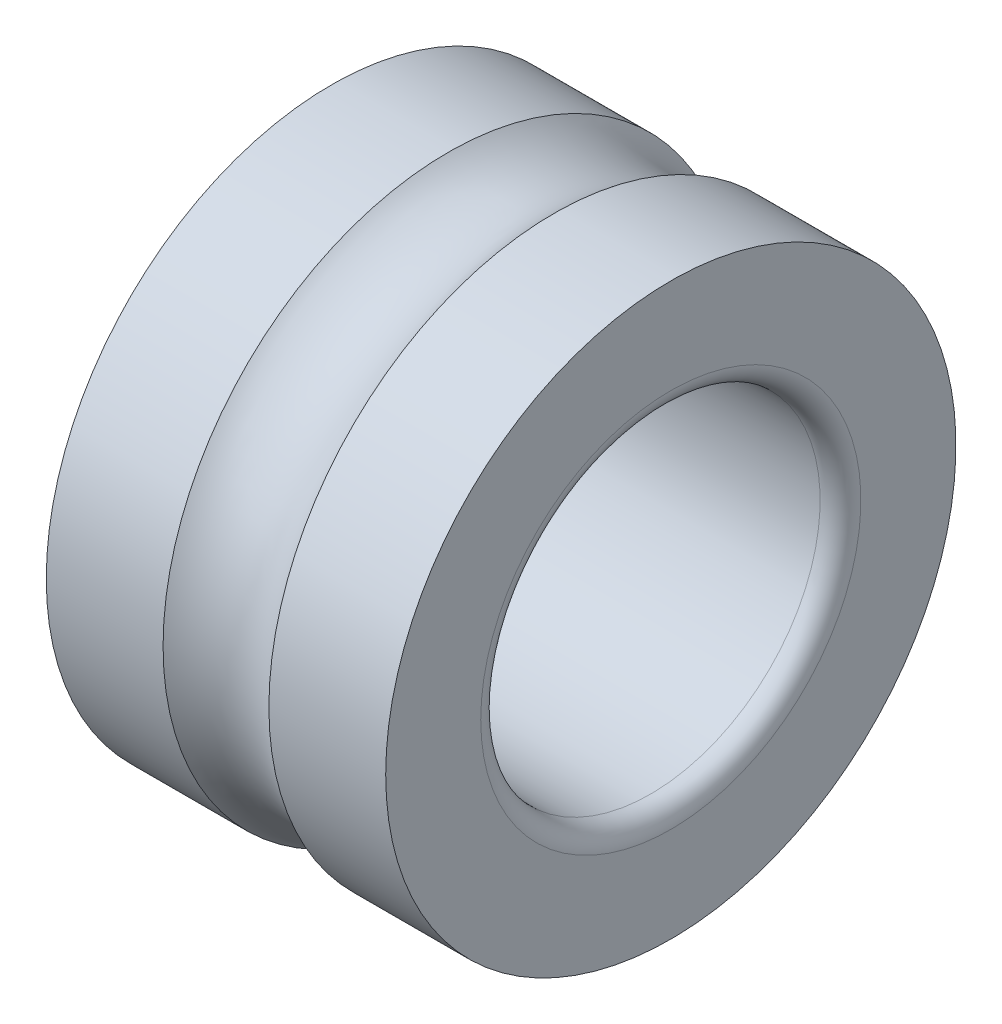
ISO-10303-21;
HEADER;
FILE_DESCRIPTION(('STEP AP214'),'2;1');
FILE_NAME('part.step','',(''),(''),'','','');
FILE_SCHEMA(('AUTOMOTIVE_DESIGN { 1 0 10303 214 1 1 1 1 }'));
ENDSEC;
DATA;
#1=APPLICATION_CONTEXT('core data for automotive mechanical design processes');
#2=APPLICATION_PROTOCOL_DEFINITION('international standard','automotive_design',2000,#1);
#3=PRODUCT_CONTEXT('',#1,'mechanical');
#4=PRODUCT('Part','Part','',(#3));
#5=PRODUCT_RELATED_PRODUCT_CATEGORY('part','',(#4));
#6=PRODUCT_DEFINITION_FORMATION('','',#4);
#7=PRODUCT_DEFINITION_CONTEXT('part definition',#1,'design');
#8=PRODUCT_DEFINITION('design','',#6,#7);
#9=PRODUCT_DEFINITION_SHAPE('','',#8);
#10=(LENGTH_UNIT() NAMED_UNIT(*) SI_UNIT(.MILLI.,.METRE.));
#11=(NAMED_UNIT(*) PLANE_ANGLE_UNIT() SI_UNIT($,.RADIAN.));
#12=(NAMED_UNIT(*) SI_UNIT($,.STERADIAN.) SOLID_ANGLE_UNIT());
#13=UNCERTAINTY_MEASURE_WITH_UNIT(LENGTH_MEASURE(1.E-05),#10,'distance_accuracy_value','');
#14=(GEOMETRIC_REPRESENTATION_CONTEXT(3) GLOBAL_UNCERTAINTY_ASSIGNED_CONTEXT((#13)) GLOBAL_UNIT_ASSIGNED_CONTEXT((#10,
#11,#12)) REPRESENTATION_CONTEXT('',''));
#15=CARTESIAN_POINT('',(0.,0.,0.));
#16=DIRECTION('',(0.,0.,1.));
#17=DIRECTION('',(1.,0.,0.));
#18=AXIS2_PLACEMENT_3D('',#15,#16,#17);
#19=CARTESIAN_POINT('',(2.5,0.,0.));
#20=DIRECTION('',(-1.,0.,0.));
#21=DIRECTION('',(0.,0.,1.));
#22=AXIS2_PLACEMENT_3D('',#19,#20,#21);
#23=TOROIDAL_SURFACE('',#22,5.1,1.1905);
#24=CARTESIAN_POINT('',(3.27928829710191,0.,0.));
#25=DIRECTION('',(-1.,0.,0.));
#26=DIRECTION('',(0.,0.,1.));
#27=AXIS2_PLACEMENT_3D('',#24,#25,#26);
#28=CIRCLE('',#27,4.2);
#29=CARTESIAN_POINT('',(3.27928829710191,0.,4.2));
#30=VERTEX_POINT('',#29);
#31=EDGE_CURVE('E55',#30,#30,#28,.T.);
#32=ORIENTED_EDGE('',*,*,#31,.T.);
#33=EDGE_LOOP('',(#32));
#34=FACE_BOUND('',#33,.T.);
#35=CARTESIAN_POINT('',(1.72071170289809,0.,0.));
#36=DIRECTION('',(-1.,0.,0.));
#37=DIRECTION('',(0.,0.,1.));
#38=AXIS2_PLACEMENT_3D('',#35,#36,#37);
#39=CIRCLE('',#38,4.2);
#40=CARTESIAN_POINT('',(1.72071170289809,0.,4.2));
#41=VERTEX_POINT('',#40);
#42=EDGE_CURVE('E10',#41,#41,#39,.T.);
#43=ORIENTED_EDGE('',*,*,#42,.F.);
#44=EDGE_LOOP('',(#43));
#45=FACE_BOUND('',#44,.T.);
#46=ADVANCED_FACE('F14',(#34,#45),#23,.F.);
#47=CARTESIAN_POINT('',(0.,0.,0.));
#48=DIRECTION('',(-1.,0.,0.));
#49=DIRECTION('',(0.,0.,1.));
#50=AXIS2_PLACEMENT_3D('',#47,#48,#49);
#51=CYLINDRICAL_SURFACE('',#50,4.2);
#52=ORIENTED_EDGE('',*,*,#42,.T.);
#53=EDGE_LOOP('',(#52));
#54=FACE_BOUND('',#53,.T.);
#55=CARTESIAN_POINT('',(0.,0.,0.));
#56=DIRECTION('',(-1.,0.,0.));
#57=DIRECTION('',(0.,0.,1.));
#58=AXIS2_PLACEMENT_3D('',#55,#56,#57);
#59=CIRCLE('',#58,4.2);
#60=CARTESIAN_POINT('',(0.,0.,4.2));
#61=VERTEX_POINT('',#60);
#62=EDGE_CURVE('E21',#61,#61,#59,.T.);
#63=ORIENTED_EDGE('',*,*,#62,.F.);
#64=EDGE_LOOP('',(#63));
#65=FACE_BOUND('',#64,.T.);
#66=ADVANCED_FACE('F76',(#54,#65),#51,.T.);
#67=CARTESIAN_POINT('',(0.,2.8,0.));
#68=DIRECTION('',(-1.,0.,0.));
#69=DIRECTION('',(0.,0.,1.));
#70=AXIS2_PLACEMENT_3D('',#67,#68,#69);
#71=PLANE('',#70);
#72=ORIENTED_EDGE('',*,*,#62,.T.);
#73=EDGE_LOOP('',(#72));
#74=FACE_BOUND('',#73,.T.);
#75=CARTESIAN_POINT('',(0.,0.,0.));
#76=DIRECTION('',(-1.,0.,0.));
#77=DIRECTION('',(0.,0.,1.));
#78=AXIS2_PLACEMENT_3D('',#75,#76,#77);
#79=CIRCLE('',#78,2.8);
#80=CARTESIAN_POINT('',(0.,0.,2.8));
#81=VERTEX_POINT('',#80);
#82=EDGE_CURVE('E30',#81,#81,#79,.T.);
#83=ORIENTED_EDGE('',*,*,#82,.F.);
#84=EDGE_LOOP('',(#83));
#85=FACE_BOUND('',#84,.T.);
#86=ADVANCED_FACE('F80',(#74,#85),#71,.T.);
#87=CARTESIAN_POINT('',(0.3,0.,0.));
#88=DIRECTION('',(-1.,0.,0.));
#89=DIRECTION('',(0.,0.,1.));
#90=AXIS2_PLACEMENT_3D('',#87,#88,#89);
#91=TOROIDAL_SURFACE('',#90,2.8,0.3);
#92=CARTESIAN_POINT('',(0.3,0.,0.));
#93=DIRECTION('',(-1.,0.,0.));
#94=DIRECTION('',(0.,0.,1.));
#95=AXIS2_PLACEMENT_3D('',#92,#93,#94);
#96=CIRCLE('',#95,2.5);
#97=CARTESIAN_POINT('',(0.3,0.,2.5));
#98=VERTEX_POINT('',#97);
#99=EDGE_CURVE('E37',#98,#98,#96,.T.);
#100=ORIENTED_EDGE('',*,*,#99,.F.);
#101=EDGE_LOOP('',(#100));
#102=FACE_BOUND('',#101,.T.);
#103=ORIENTED_EDGE('',*,*,#82,.T.);
#104=EDGE_LOOP('',(#103));
#105=FACE_BOUND('',#104,.T.);
#106=ADVANCED_FACE('F84',(#102,#105),#91,.T.);
#107=CARTESIAN_POINT('',(0.,0.,0.));
#108=DIRECTION('',(-1.,0.,0.));
#109=DIRECTION('',(0.,0.,1.));
#110=AXIS2_PLACEMENT_3D('',#107,#108,#109);
#111=CYLINDRICAL_SURFACE('',#110,2.5);
#112=CARTESIAN_POINT('',(4.7,0.,0.));
#113=DIRECTION('',(-1.,0.,0.));
#114=DIRECTION('',(0.,0.,1.));
#115=AXIS2_PLACEMENT_3D('',#112,#113,#114);
#116=CIRCLE('',#115,2.5);
#117=CARTESIAN_POINT('',(4.7,0.,2.5));
#118=VERTEX_POINT('',#117);
#119=EDGE_CURVE('E43',#118,#118,#116,.T.);
#120=ORIENTED_EDGE('',*,*,#119,.F.);
#121=EDGE_LOOP('',(#120));
#122=FACE_BOUND('',#121,.T.);
#123=ORIENTED_EDGE('',*,*,#99,.T.);
#124=EDGE_LOOP('',(#123));
#125=FACE_BOUND('',#124,.T.);
#126=ADVANCED_FACE('F90',(#122,#125),#111,.F.);
#127=CARTESIAN_POINT('',(4.7,0.,0.));
#128=DIRECTION('',(-1.,0.,0.));
#129=DIRECTION('',(0.,0.,1.));
#130=AXIS2_PLACEMENT_3D('',#127,#128,#129);
#131=TOROIDAL_SURFACE('',#130,2.8,0.3);
#132=CARTESIAN_POINT('',(5.,0.,0.));
#133=DIRECTION('',(-1.,0.,0.));
#134=DIRECTION('',(0.,0.,1.));
#135=AXIS2_PLACEMENT_3D('',#132,#133,#134);
#136=CIRCLE('',#135,2.8);
#137=CARTESIAN_POINT('',(5.,0.,2.8));
#138=VERTEX_POINT('',#137);
#139=EDGE_CURVE('E47',#138,#138,#136,.T.);
#140=ORIENTED_EDGE('',*,*,#139,.F.);
#141=EDGE_LOOP('',(#140));
#142=FACE_BOUND('',#141,.T.);
#143=ORIENTED_EDGE('',*,*,#119,.T.);
#144=EDGE_LOOP('',(#143));
#145=FACE_BOUND('',#144,.T.);
#146=ADVANCED_FACE('F72',(#142,#145),#131,.T.);
#147=CARTESIAN_POINT('',(5.,2.8,0.));
#148=DIRECTION('',(-1.,0.,0.));
#149=DIRECTION('',(0.,0.,1.));
#150=AXIS2_PLACEMENT_3D('',#147,#148,#149);
#151=PLANE('',#150);
#152=CARTESIAN_POINT('',(5.,0.,0.));
#153=DIRECTION('',(-1.,0.,0.));
#154=DIRECTION('',(0.,0.,1.));
#155=AXIS2_PLACEMENT_3D('',#152,#153,#154);
#156=CIRCLE('',#155,4.2);
#157=CARTESIAN_POINT('',(5.,0.,4.2));
#158=VERTEX_POINT('',#157);
#159=EDGE_CURVE('E51',#158,#158,#156,.T.);
#160=ORIENTED_EDGE('',*,*,#159,.F.);
#161=EDGE_LOOP('',(#160));
#162=FACE_BOUND('',#161,.T.);
#163=ORIENTED_EDGE('',*,*,#139,.T.);
#164=EDGE_LOOP('',(#163));
#165=FACE_BOUND('',#164,.T.);
#166=ADVANCED_FACE('F65',(#162,#165),#151,.F.);
#167=CARTESIAN_POINT('',(0.,0.,0.));
#168=DIRECTION('',(-1.,0.,0.));
#169=DIRECTION('',(0.,0.,1.));
#170=AXIS2_PLACEMENT_3D('',#167,#168,#169);
#171=CYLINDRICAL_SURFACE('',#170,4.2);
#172=ORIENTED_EDGE('',*,*,#159,.T.);
#173=EDGE_LOOP('',(#172));
#174=FACE_BOUND('',#173,.T.);
#175=ORIENTED_EDGE('',*,*,#31,.F.);
#176=EDGE_LOOP('',(#175));
#177=FACE_BOUND('',#176,.T.);
#178=ADVANCED_FACE('F63',(#174,#177),#171,.T.);
#179=CLOSED_SHELL('',(#46,#66,#86,#106,#126,#146,#166,#178));
#180=MANIFOLD_SOLID_BREP('B1',#179);
#181=ADVANCED_BREP_SHAPE_REPRESENTATION('',(#18,#180),#14);
#182=SHAPE_DEFINITION_REPRESENTATION(#9,#181);
ENDSEC;
END-ISO-10303-21;
